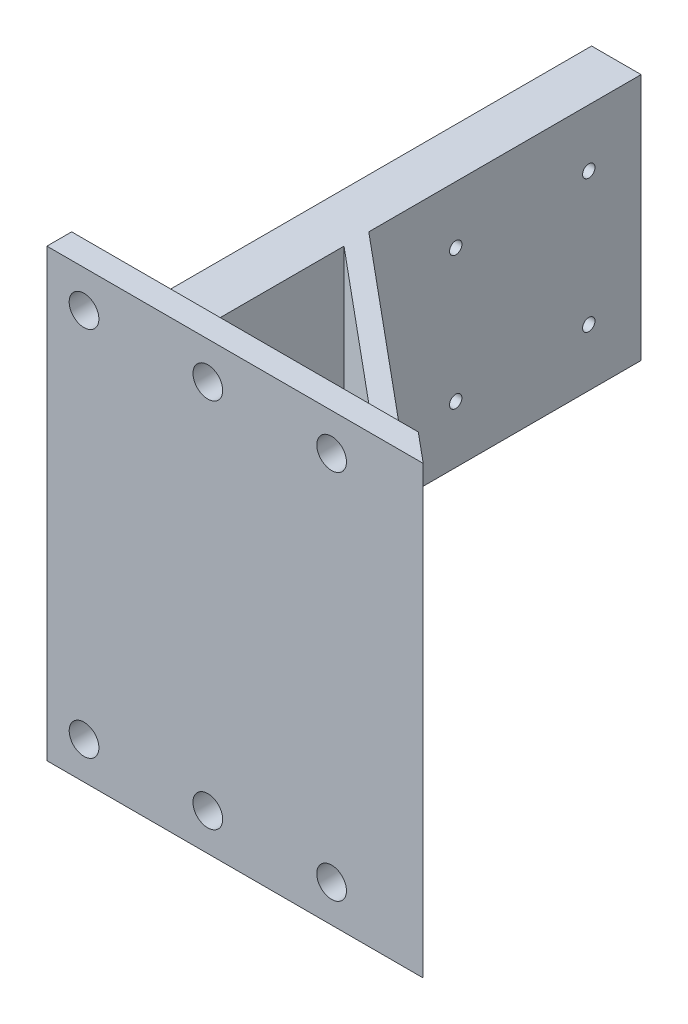
ISO-10303-21;
HEADER;
FILE_DESCRIPTION(('STEP AP214'),'2;1');
FILE_NAME('part.step','',(''),(''),'','','');
FILE_SCHEMA(('AUTOMOTIVE_DESIGN { 1 0 10303 214 1 1 1 1 }'));
ENDSEC;
DATA;
#1=APPLICATION_CONTEXT('core data for automotive mechanical design processes');
#2=APPLICATION_PROTOCOL_DEFINITION('international standard','automotive_design',2000,#1);
#3=PRODUCT_CONTEXT('',#1,'mechanical');
#4=PRODUCT('Part','Part','',(#3));
#5=PRODUCT_RELATED_PRODUCT_CATEGORY('part','',(#4));
#6=PRODUCT_DEFINITION_FORMATION('','',#4);
#7=PRODUCT_DEFINITION_CONTEXT('part definition',#1,'design');
#8=PRODUCT_DEFINITION('design','',#6,#7);
#9=PRODUCT_DEFINITION_SHAPE('','',#8);
#10=(LENGTH_UNIT() NAMED_UNIT(*) SI_UNIT(.MILLI.,.METRE.));
#11=(NAMED_UNIT(*) PLANE_ANGLE_UNIT() SI_UNIT($,.RADIAN.));
#12=(NAMED_UNIT(*) SI_UNIT($,.STERADIAN.) SOLID_ANGLE_UNIT());
#13=UNCERTAINTY_MEASURE_WITH_UNIT(LENGTH_MEASURE(1.E-05),#10,'distance_accuracy_value','');
#14=(GEOMETRIC_REPRESENTATION_CONTEXT(3) GLOBAL_UNCERTAINTY_ASSIGNED_CONTEXT((#13)) GLOBAL_UNIT_ASSIGNED_CONTEXT((#10,
#11,#12)) REPRESENTATION_CONTEXT('',''));
#15=CARTESIAN_POINT('',(0.,0.,0.));
#16=DIRECTION('',(0.,0.,1.));
#17=DIRECTION('',(1.,0.,0.));
#18=AXIS2_PLACEMENT_3D('',#15,#16,#17);
#19=CARTESIAN_POINT('',(10.,50.,-5.));
#20=DIRECTION('',(0.,0.,-1.));
#21=DIRECTION('',(-1.,0.,0.));
#22=AXIS2_PLACEMENT_3D('',#19,#20,#21);
#23=PLANE('',#22);
#24=CARTESIAN_POINT('',(57.5,-12.4999999999997,-5.));
#25=DIRECTION('',(0.,0.,1.));
#26=DIRECTION('',(-1.,0.,0.));
#27=AXIS2_PLACEMENT_3D('',#24,#25,#26);
#28=CIRCLE('',#27,3.00000000000001);
#29=CARTESIAN_POINT('',(54.5,-12.4999999999997,-5.));
#30=VERTEX_POINT('',#29);
#31=EDGE_CURVE('E325',#30,#30,#28,.T.);
#32=ORIENTED_EDGE('',*,*,#31,.T.);
#33=EDGE_LOOP('',(#32));
#34=FACE_BOUND('',#33,.T.);
#35=CARTESIAN_POINT('',(7.5,-12.5,-5.));
#36=DIRECTION('',(0.,0.,1.));
#37=DIRECTION('',(-1.,0.,0.));
#38=AXIS2_PLACEMENT_3D('',#35,#36,#37);
#39=CIRCLE('',#38,3.);
#40=CARTESIAN_POINT('',(4.5,-12.5,-5.));
#41=VERTEX_POINT('',#40);
#42=EDGE_CURVE('E319',#41,#41,#39,.T.);
#43=ORIENTED_EDGE('',*,*,#42,.T.);
#44=EDGE_LOOP('',(#43));
#45=FACE_BOUND('',#44,.T.);
#46=CARTESIAN_POINT('',(32.5,-12.4999999999998,-5.));
#47=DIRECTION('',(0.,0.,1.));
#48=DIRECTION('',(-1.,0.,0.));
#49=AXIS2_PLACEMENT_3D('',#46,#47,#48);
#50=CIRCLE('',#49,3.);
#51=CARTESIAN_POINT('',(29.5,-12.4999999999998,-5.));
#52=VERTEX_POINT('',#51);
#53=EDGE_CURVE('E322',#52,#52,#50,.T.);
#54=ORIENTED_EDGE('',*,*,#53,.T.);
#55=EDGE_LOOP('',(#54));
#56=FACE_BOUND('',#55,.T.);
#57=CARTESIAN_POINT('',(57.5,62.4999999999997,-5.));
#58=DIRECTION('',(0.,0.,-1.));
#59=DIRECTION('',(-1.,0.,0.));
#60=AXIS2_PLACEMENT_3D('',#57,#58,#59);
#61=CIRCLE('',#60,3.00000000000001);
#62=CARTESIAN_POINT('',(54.5,62.4999999999997,-5.));
#63=VERTEX_POINT('',#62);
#64=EDGE_CURVE('E342',#63,#63,#61,.T.);
#65=ORIENTED_EDGE('',*,*,#64,.F.);
#66=EDGE_LOOP('',(#65));
#67=FACE_BOUND('',#66,.T.);
#68=CARTESIAN_POINT('',(7.5,62.5,-5.));
#69=DIRECTION('',(0.,0.,-1.));
#70=DIRECTION('',(-1.,0.,0.));
#71=AXIS2_PLACEMENT_3D('',#68,#69,#70);
#72=CIRCLE('',#71,3.);
#73=CARTESIAN_POINT('',(4.5,62.5,-5.));
#74=VERTEX_POINT('',#73);
#75=EDGE_CURVE('E335',#74,#74,#72,.T.);
#76=ORIENTED_EDGE('',*,*,#75,.F.);
#77=EDGE_LOOP('',(#76));
#78=FACE_BOUND('',#77,.T.);
#79=CARTESIAN_POINT('',(32.5,62.4999999999998,-5.));
#80=DIRECTION('',(0.,0.,-1.));
#81=DIRECTION('',(-1.,0.,0.));
#82=AXIS2_PLACEMENT_3D('',#79,#80,#81);
#83=CIRCLE('',#82,3.);
#84=CARTESIAN_POINT('',(29.5,62.4999999999998,-5.));
#85=VERTEX_POINT('',#84);
#86=EDGE_CURVE('E338',#85,#85,#83,.T.);
#87=ORIENTED_EDGE('',*,*,#86,.F.);
#88=EDGE_LOOP('',(#87));
#89=FACE_BOUND('',#88,.T.);
#90=DIRECTION('',(1.,0.,0.));
#91=VECTOR('',#90,1.);
#92=CARTESIAN_POINT('',(76.,0.,-5.));
#93=LINE('',#92,#91);
#94=CARTESIAN_POINT('',(64.,0.,-5.));
#95=VERTEX_POINT('',#94);
#96=CARTESIAN_POINT('',(70.,0.,-5.));
#97=VERTEX_POINT('',#96);
#98=EDGE_CURVE('E42',#95,#97,#93,.T.);
#99=ORIENTED_EDGE('',*,*,#98,.T.);
#100=DIRECTION('',(0.,1.,0.));
#101=VECTOR('',#100,1.);
#102=CARTESIAN_POINT('',(70.,-44.,-5.));
#103=LINE('',#102,#101);
#104=CARTESIAN_POINT('',(70.,-20.,-5.));
#105=VERTEX_POINT('',#104);
#106=EDGE_CURVE('E123',#105,#97,#103,.T.);
#107=ORIENTED_EDGE('',*,*,#106,.F.);
#108=DIRECTION('',(-1.,0.,0.));
#109=VECTOR('',#108,1.);
#110=CARTESIAN_POINT('',(0.,-20.,-5.));
#111=LINE('',#110,#109);
#112=CARTESIAN_POINT('',(0.,-20.,-5.));
#113=VERTEX_POINT('',#112);
#114=EDGE_CURVE('E157',#105,#113,#111,.T.);
#115=ORIENTED_EDGE('',*,*,#114,.T.);
#116=DIRECTION('',(0.,1.,0.));
#117=VECTOR('',#116,1.);
#118=CARTESIAN_POINT('',(0.,0.,-5.));
#119=LINE('',#118,#117);
#120=CARTESIAN_POINT('',(0.,0.,-5.));
#121=VERTEX_POINT('',#120);
#122=EDGE_CURVE('E154',#113,#121,#119,.T.);
#123=ORIENTED_EDGE('',*,*,#122,.T.);
#124=CARTESIAN_POINT('',(10.,0.,-5.));
#125=VERTEX_POINT('',#124);
#126=EDGE_CURVE('E49',#121,#125,#93,.T.);
#127=ORIENTED_EDGE('',*,*,#126,.T.);
#128=DIRECTION('',(0.,-1.,0.));
#129=VECTOR('',#128,1.);
#130=CARTESIAN_POINT('',(10.,50.,-5.));
#131=LINE('',#130,#129);
#132=CARTESIAN_POINT('',(9.99999999999999,50.,-5.));
#133=VERTEX_POINT('',#132);
#134=EDGE_CURVE('E142',#133,#125,#131,.T.);
#135=ORIENTED_EDGE('',*,*,#134,.F.);
#136=DIRECTION('',(1.,0.,0.));
#137=VECTOR('',#136,1.);
#138=CARTESIAN_POINT('',(76.,50.,-5.));
#139=LINE('',#138,#137);
#140=CARTESIAN_POINT('',(0.,50.,-5.));
#141=VERTEX_POINT('',#140);
#142=EDGE_CURVE('E152',#141,#133,#139,.T.);
#143=ORIENTED_EDGE('',*,*,#142,.F.);
#144=DIRECTION('',(0.,-1.,0.));
#145=VECTOR('',#144,1.);
#146=CARTESIAN_POINT('',(0.,50.,-5.));
#147=LINE('',#146,#145);
#148=CARTESIAN_POINT('',(0.,70.,-5.));
#149=VERTEX_POINT('',#148);
#150=EDGE_CURVE('E176',#149,#141,#147,.T.);
#151=ORIENTED_EDGE('',*,*,#150,.F.);
#152=DIRECTION('',(-1.,0.,0.));
#153=VECTOR('',#152,1.);
#154=CARTESIAN_POINT('',(0.,70.,-5.));
#155=LINE('',#154,#153);
#156=CARTESIAN_POINT('',(70.,70.,-5.));
#157=VERTEX_POINT('',#156);
#158=EDGE_CURVE('E174',#157,#149,#155,.T.);
#159=ORIENTED_EDGE('',*,*,#158,.F.);
#160=DIRECTION('',(0.,-1.,0.));
#161=VECTOR('',#160,1.);
#162=CARTESIAN_POINT('',(70.,94.,-5.));
#163=LINE('',#162,#161);
#164=CARTESIAN_POINT('',(70.,50.,-5.));
#165=VERTEX_POINT('',#164);
#166=EDGE_CURVE('E168',#157,#165,#163,.T.);
#167=ORIENTED_EDGE('',*,*,#166,.T.);
#168=CARTESIAN_POINT('',(64.,50.,-5.));
#169=VERTEX_POINT('',#168);
#170=EDGE_CURVE('E147',#169,#165,#139,.T.);
#171=ORIENTED_EDGE('',*,*,#170,.F.);
#172=DIRECTION('',(0.,-1.,0.));
#173=VECTOR('',#172,1.);
#174=CARTESIAN_POINT('',(64.,50.,-5.));
#175=LINE('',#174,#173);
#176=EDGE_CURVE('E145',#169,#95,#175,.T.);
#177=ORIENTED_EDGE('',*,*,#176,.T.);
#178=EDGE_LOOP('',(#99,#107,#115,#123,#127,#135,#143,#151,#159,#167,#171,#177));
#179=FACE_BOUND('',#178,.T.);
#180=ADVANCED_FACE('F34',(#34,#45,#56,#67,#78,#89,#179),#23,.T.);
#181=CARTESIAN_POINT('',(0.,-20.,-5.));
#182=DIRECTION('',(0.,1.,0.));
#183=DIRECTION('',(0.,0.,1.));
#184=AXIS2_PLACEMENT_3D('',#181,#182,#183);
#185=PLANE('',#184);
#186=DIRECTION('',(-0.768221279597376,0.,-0.64018439966448));
#187=VECTOR('',#186,1.);
#188=CARTESIAN_POINT('',(28.6885245901639,-20.,-39.4262295081967));
#189=LINE('',#188,#187);
#190=CARTESIAN_POINT('',(76.,-20.,0.));
#191=VERTEX_POINT('',#190);
#192=EDGE_CURVE('E11',#191,#105,#189,.T.);
#193=ORIENTED_EDGE('',*,*,#192,.F.);
#194=DIRECTION('',(-1.,0.,0.));
#195=VECTOR('',#194,1.);
#196=CARTESIAN_POINT('',(0.,-20.,0.));
#197=LINE('',#196,#195);
#198=CARTESIAN_POINT('',(0.,-20.,0.));
#199=VERTEX_POINT('',#198);
#200=EDGE_CURVE('E133',#191,#199,#197,.T.);
#201=ORIENTED_EDGE('',*,*,#200,.T.);
#202=DIRECTION('',(0.,0.,1.));
#203=VECTOR('',#202,1.);
#204=CARTESIAN_POINT('',(0.,-20.,-5.));
#205=LINE('',#204,#203);
#206=EDGE_CURVE('E166',#113,#199,#205,.T.);
#207=ORIENTED_EDGE('',*,*,#206,.F.);
#208=ORIENTED_EDGE('',*,*,#114,.F.);
#209=EDGE_LOOP('',(#193,#201,#207,#208));
#210=FACE_BOUND('',#209,.T.);
#211=ADVANCED_FACE('F222',(#210),#185,.F.);
#212=CARTESIAN_POINT('',(0.,50.,0.));
#213=DIRECTION('',(0.,-1.,0.));
#214=DIRECTION('',(0.,0.,-1.));
#215=AXIS2_PLACEMENT_3D('',#212,#213,#214);
#216=PLANE('',#215);
#217=DIRECTION('',(0.,0.,1.));
#218=VECTOR('',#217,1.);
#219=CARTESIAN_POINT('',(0.,50.,0.));
#220=LINE('',#219,#218);
#221=CARTESIAN_POINT('',(0.,50.,-110.));
#222=VERTEX_POINT('',#221);
#223=EDGE_CURVE('E203',#222,#141,#220,.T.);
#224=ORIENTED_EDGE('',*,*,#223,.T.);
#225=ORIENTED_EDGE('',*,*,#142,.T.);
#226=DIRECTION('',(0.,0.,1.));
#227=VECTOR('',#226,1.);
#228=CARTESIAN_POINT('',(10.,50.,-50.));
#229=LINE('',#228,#227);
#230=CARTESIAN_POINT('',(10.,50.,-50.));
#231=VERTEX_POINT('',#230);
#232=EDGE_CURVE('E184',#231,#133,#229,.T.);
#233=ORIENTED_EDGE('',*,*,#232,.F.);
#234=DIRECTION('',(-0.768221279597376,0.,-0.64018439966448));
#235=VECTOR('',#234,1.);
#236=CARTESIAN_POINT('',(64.,50.,-5.));
#237=LINE('',#236,#235);
#238=EDGE_CURVE('E187',#169,#231,#237,.T.);
#239=ORIENTED_EDGE('',*,*,#238,.F.);
#240=ORIENTED_EDGE('',*,*,#170,.T.);
#241=DIRECTION('',(-0.768221279597376,0.,-0.64018439966448));
#242=VECTOR('',#241,1.);
#243=CARTESIAN_POINT('',(10.,50.,-55.));
#244=LINE('',#243,#242);
#245=CARTESIAN_POINT('',(10.,50.,-55.));
#246=VERTEX_POINT('',#245);
#247=EDGE_CURVE('E196',#165,#246,#244,.T.);
#248=ORIENTED_EDGE('',*,*,#247,.T.);
#249=DIRECTION('',(0.,0.,-1.));
#250=VECTOR('',#249,1.);
#251=CARTESIAN_POINT('',(9.99999999999998,50.,-110.));
#252=LINE('',#251,#250);
#253=CARTESIAN_POINT('',(9.99999999999998,50.,-110.));
#254=VERTEX_POINT('',#253);
#255=EDGE_CURVE('E198',#246,#254,#252,.T.);
#256=ORIENTED_EDGE('',*,*,#255,.T.);
#257=DIRECTION('',(-1.,0.,0.));
#258=VECTOR('',#257,1.);
#259=CARTESIAN_POINT('',(0.,50.,-110.));
#260=LINE('',#259,#258);
#261=EDGE_CURVE('E201',#254,#222,#260,.T.);
#262=ORIENTED_EDGE('',*,*,#261,.T.);
#263=EDGE_LOOP('',(#224,#225,#233,#239,#240,#248,#256,#262));
#264=FACE_BOUND('',#263,.T.);
#265=ADVANCED_FACE('F233',(#264),#216,.F.);
#266=CARTESIAN_POINT('',(0.,0.,0.));
#267=DIRECTION('',(0.,-1.,0.));
#268=DIRECTION('',(0.,0.,-1.));
#269=AXIS2_PLACEMENT_3D('',#266,#267,#268);
#270=PLANE('',#269);
#271=ORIENTED_EDGE('',*,*,#126,.F.);
#272=DIRECTION('',(0.,0.,1.));
#273=VECTOR('',#272,1.);
#274=CARTESIAN_POINT('',(0.,0.,0.));
#275=LINE('',#274,#273);
#276=CARTESIAN_POINT('',(0.,0.,-110.));
#277=VERTEX_POINT('',#276);
#278=EDGE_CURVE('E199',#277,#121,#275,.T.);
#279=ORIENTED_EDGE('',*,*,#278,.F.);
#280=DIRECTION('',(-1.,0.,0.));
#281=VECTOR('',#280,1.);
#282=CARTESIAN_POINT('',(0.,0.,-110.));
#283=LINE('',#282,#281);
#284=CARTESIAN_POINT('',(9.99999999999998,0.,-110.));
#285=VERTEX_POINT('',#284);
#286=EDGE_CURVE('E208',#285,#277,#283,.T.);
#287=ORIENTED_EDGE('',*,*,#286,.F.);
#288=DIRECTION('',(0.,0.,-1.));
#289=VECTOR('',#288,1.);
#290=CARTESIAN_POINT('',(9.99999999999998,0.,-110.));
#291=LINE('',#290,#289);
#292=CARTESIAN_POINT('',(10.,0.,-55.));
#293=VERTEX_POINT('',#292);
#294=EDGE_CURVE('E141',#293,#285,#291,.T.);
#295=ORIENTED_EDGE('',*,*,#294,.F.);
#296=DIRECTION('',(-0.768221279597376,0.,-0.64018439966448));
#297=VECTOR('',#296,1.);
#298=CARTESIAN_POINT('',(10.,0.,-55.));
#299=LINE('',#298,#297);
#300=EDGE_CURVE('E127',#97,#293,#299,.T.);
#301=ORIENTED_EDGE('',*,*,#300,.F.);
#302=ORIENTED_EDGE('',*,*,#98,.F.);
#303=DIRECTION('',(-0.768221279597376,0.,-0.64018439966448));
#304=VECTOR('',#303,1.);
#305=CARTESIAN_POINT('',(64.,0.,-5.));
#306=LINE('',#305,#304);
#307=CARTESIAN_POINT('',(10.,0.,-50.));
#308=VERTEX_POINT('',#307);
#309=EDGE_CURVE('E188',#95,#308,#306,.T.);
#310=ORIENTED_EDGE('',*,*,#309,.T.);
#311=DIRECTION('',(0.,0.,1.));
#312=VECTOR('',#311,1.);
#313=CARTESIAN_POINT('',(10.,0.,-50.));
#314=LINE('',#313,#312);
#315=EDGE_CURVE('E56',#308,#125,#314,.T.);
#316=ORIENTED_EDGE('',*,*,#315,.T.);
#317=EDGE_LOOP('',(#271,#279,#287,#295,#301,#302,#310,#316));
#318=FACE_BOUND('',#317,.T.);
#319=ADVANCED_FACE('F137',(#318),#270,.T.);
#320=CARTESIAN_POINT('',(76.,50.,0.));
#321=DIRECTION('',(0.,0.,-1.));
#322=DIRECTION('',(-1.,0.,0.));
#323=AXIS2_PLACEMENT_3D('',#320,#321,#322);
#324=PLANE('',#323);
#325=CARTESIAN_POINT('',(57.5,-12.4999999999997,0.));
#326=DIRECTION('',(0.,0.,1.));
#327=DIRECTION('',(-1.,0.,0.));
#328=AXIS2_PLACEMENT_3D('',#325,#326,#327);
#329=CIRCLE('',#328,3.00000000000001);
#330=CARTESIAN_POINT('',(54.5,-12.4999999999997,0.));
#331=VERTEX_POINT('',#330);
#332=EDGE_CURVE('E320',#331,#331,#329,.T.);
#333=ORIENTED_EDGE('',*,*,#332,.F.);
#334=EDGE_LOOP('',(#333));
#335=FACE_BOUND('',#334,.T.);
#336=CARTESIAN_POINT('',(7.5,-12.5,0.));
#337=DIRECTION('',(0.,0.,1.));
#338=DIRECTION('',(-1.,0.,0.));
#339=AXIS2_PLACEMENT_3D('',#336,#337,#338);
#340=CIRCLE('',#339,3.);
#341=CARTESIAN_POINT('',(4.5,-12.5,0.));
#342=VERTEX_POINT('',#341);
#343=EDGE_CURVE('E316',#342,#342,#340,.T.);
#344=ORIENTED_EDGE('',*,*,#343,.F.);
#345=EDGE_LOOP('',(#344));
#346=FACE_BOUND('',#345,.T.);
#347=CARTESIAN_POINT('',(32.5,-12.4999999999998,0.));
#348=DIRECTION('',(0.,0.,1.));
#349=DIRECTION('',(-1.,0.,0.));
#350=AXIS2_PLACEMENT_3D('',#347,#348,#349);
#351=CIRCLE('',#350,3.);
#352=CARTESIAN_POINT('',(29.5,-12.4999999999998,0.));
#353=VERTEX_POINT('',#352);
#354=EDGE_CURVE('E329',#353,#353,#351,.T.);
#355=ORIENTED_EDGE('',*,*,#354,.F.);
#356=EDGE_LOOP('',(#355));
#357=FACE_BOUND('',#356,.T.);
#358=CARTESIAN_POINT('',(57.5,62.4999999999997,0.));
#359=DIRECTION('',(0.,0.,-1.));
#360=DIRECTION('',(-1.,0.,0.));
#361=AXIS2_PLACEMENT_3D('',#358,#359,#360);
#362=CIRCLE('',#361,3.00000000000001);
#363=CARTESIAN_POINT('',(54.5,62.4999999999997,0.));
#364=VERTEX_POINT('',#363);
#365=EDGE_CURVE('E332',#364,#364,#362,.T.);
#366=ORIENTED_EDGE('',*,*,#365,.T.);
#367=EDGE_LOOP('',(#366));
#368=FACE_BOUND('',#367,.T.);
#369=CARTESIAN_POINT('',(7.5,62.5,0.));
#370=DIRECTION('',(0.,0.,-1.));
#371=DIRECTION('',(-1.,0.,0.));
#372=AXIS2_PLACEMENT_3D('',#369,#370,#371);
#373=CIRCLE('',#372,3.);
#374=CARTESIAN_POINT('',(4.5,62.5,0.));
#375=VERTEX_POINT('',#374);
#376=EDGE_CURVE('E339',#375,#375,#373,.T.);
#377=ORIENTED_EDGE('',*,*,#376,.T.);
#378=EDGE_LOOP('',(#377));
#379=FACE_BOUND('',#378,.T.);
#380=CARTESIAN_POINT('',(32.5,62.4999999999998,0.));
#381=DIRECTION('',(0.,0.,-1.));
#382=DIRECTION('',(-1.,0.,0.));
#383=AXIS2_PLACEMENT_3D('',#380,#381,#382);
#384=CIRCLE('',#383,3.);
#385=CARTESIAN_POINT('',(29.5,62.4999999999998,0.));
#386=VERTEX_POINT('',#385);
#387=EDGE_CURVE('E347',#386,#386,#384,.T.);
#388=ORIENTED_EDGE('',*,*,#387,.T.);
#389=EDGE_LOOP('',(#388));
#390=FACE_BOUND('',#389,.T.);
#391=DIRECTION('',(0.,-1.,0.));
#392=VECTOR('',#391,1.);
#393=CARTESIAN_POINT('',(0.,50.,0.));
#394=LINE('',#393,#392);
#395=CARTESIAN_POINT('',(0.,70.,0.));
#396=VERTEX_POINT('',#395);
#397=EDGE_CURVE('E205',#396,#199,#394,.T.);
#398=ORIENTED_EDGE('',*,*,#397,.T.);
#399=ORIENTED_EDGE('',*,*,#200,.F.);
#400=DIRECTION('',(0.,-1.,0.));
#401=VECTOR('',#400,1.);
#402=CARTESIAN_POINT('',(76.,50.,0.));
#403=LINE('',#402,#401);
#404=CARTESIAN_POINT('',(76.,70.,0.));
#405=VERTEX_POINT('',#404);
#406=EDGE_CURVE('E150',#405,#191,#403,.T.);
#407=ORIENTED_EDGE('',*,*,#406,.F.);
#408=DIRECTION('',(-1.,0.,0.));
#409=VECTOR('',#408,1.);
#410=CARTESIAN_POINT('',(0.,70.,0.));
#411=LINE('',#410,#409);
#412=EDGE_CURVE('E172',#405,#396,#411,.T.);
#413=ORIENTED_EDGE('',*,*,#412,.T.);
#414=EDGE_LOOP('',(#398,#399,#407,#413));
#415=FACE_BOUND('',#414,.T.);
#416=ADVANCED_FACE('F36',(#335,#346,#357,#368,#379,#390,#415),#324,.F.);
#417=CARTESIAN_POINT('',(10.,50.,-55.));
#418=DIRECTION('',(-0.64018439966448,0.,0.768221279597376));
#419=DIRECTION('',(0.768221279597376,0.,0.64018439966448));
#420=AXIS2_PLACEMENT_3D('',#417,#418,#419);
#421=PLANE('',#420);
#422=ORIENTED_EDGE('',*,*,#406,.T.);
#423=ORIENTED_EDGE('',*,*,#192,.T.);
#424=ORIENTED_EDGE('',*,*,#106,.T.);
#425=ORIENTED_EDGE('',*,*,#300,.T.);
#426=DIRECTION('',(0.,-1.,0.));
#427=VECTOR('',#426,1.);
#428=CARTESIAN_POINT('',(10.,50.,-55.));
#429=LINE('',#428,#427);
#430=EDGE_CURVE('E218',#246,#293,#429,.T.);
#431=ORIENTED_EDGE('',*,*,#430,.F.);
#432=ORIENTED_EDGE('',*,*,#247,.F.);
#433=ORIENTED_EDGE('',*,*,#166,.F.);
#434=DIRECTION('',(0.768221279597376,0.,0.64018439966448));
#435=VECTOR('',#434,1.);
#436=CARTESIAN_POINT('',(28.6885245901639,70.,-39.4262295081967));
#437=LINE('',#436,#435);
#438=EDGE_CURVE('E170',#157,#405,#437,.T.);
#439=ORIENTED_EDGE('',*,*,#438,.T.);
#440=EDGE_LOOP('',(#422,#423,#424,#425,#431,#432,#433,#439));
#441=FACE_BOUND('',#440,.T.);
#442=ADVANCED_FACE('F125',(#441),#421,.F.);
#443=CARTESIAN_POINT('',(9.99999999999998,50.,-110.));
#444=DIRECTION('',(-1.,0.,0.));
#445=DIRECTION('',(0.,0.,1.));
#446=AXIS2_PLACEMENT_3D('',#443,#444,#445);
#447=PLANE('',#446);
#448=CARTESIAN_POINT('',(9.99999999999999,38.4350288425444,-72.5649711574556));
#449=DIRECTION('',(-1.,0.,0.));
#450=DIRECTION('',(0.,0.,1.));
#451=AXIS2_PLACEMENT_3D('',#448,#449,#450);
#452=CIRCLE('',#451,1.25);
#453=CARTESIAN_POINT('',(9.99999999999999,38.4350288425444,-71.3149711574556));
#454=VERTEX_POINT('',#453);
#455=EDGE_CURVE('E134',#454,#454,#452,.T.);
#456=ORIENTED_EDGE('',*,*,#455,.T.);
#457=EDGE_LOOP('',(#456));
#458=FACE_BOUND('',#457,.T.);
#459=CARTESIAN_POINT('',(9.99999999999998,11.5649711574553,-99.4350288425441));
#460=DIRECTION('',(-1.,0.,0.));
#461=DIRECTION('',(0.,0.,1.));
#462=AXIS2_PLACEMENT_3D('',#459,#460,#461);
#463=CIRCLE('',#462,1.25000000000001);
#464=CARTESIAN_POINT('',(9.99999999999998,11.5649711574553,-98.1850288425441));
#465=VERTEX_POINT('',#464);
#466=EDGE_CURVE('E370',#465,#465,#463,.T.);
#467=ORIENTED_EDGE('',*,*,#466,.T.);
#468=EDGE_LOOP('',(#467));
#469=FACE_BOUND('',#468,.T.);
#470=CARTESIAN_POINT('',(9.99999999999999,11.5649711574556,-72.5649711574552));
#471=DIRECTION('',(-1.,0.,0.));
#472=DIRECTION('',(0.,0.,1.));
#473=AXIS2_PLACEMENT_3D('',#470,#471,#472);
#474=CIRCLE('',#473,1.25);
#475=CARTESIAN_POINT('',(9.99999999999999,11.5649711574556,-71.3149711574552));
#476=VERTEX_POINT('',#475);
#477=EDGE_CURVE('E367',#476,#476,#474,.T.);
#478=ORIENTED_EDGE('',*,*,#477,.T.);
#479=EDGE_LOOP('',(#478));
#480=FACE_BOUND('',#479,.T.);
#481=CARTESIAN_POINT('',(9.99999999999998,38.4350288425441,-99.4350288425443));
#482=DIRECTION('',(-1.,0.,0.));
#483=DIRECTION('',(0.,0.,1.));
#484=AXIS2_PLACEMENT_3D('',#481,#482,#483);
#485=CIRCLE('',#484,1.24999999999999);
#486=CARTESIAN_POINT('',(9.99999999999998,38.4350288425441,-98.1850288425443));
#487=VERTEX_POINT('',#486);
#488=EDGE_CURVE('E364',#487,#487,#485,.T.);
#489=ORIENTED_EDGE('',*,*,#488,.T.);
#490=EDGE_LOOP('',(#489));
#491=FACE_BOUND('',#490,.T.);
#492=ORIENTED_EDGE('',*,*,#294,.T.);
#493=DIRECTION('',(0.,-1.,0.));
#494=VECTOR('',#493,1.);
#495=CARTESIAN_POINT('',(9.99999999999998,50.,-110.));
#496=LINE('',#495,#494);
#497=EDGE_CURVE('E215',#254,#285,#496,.T.);
#498=ORIENTED_EDGE('',*,*,#497,.F.);
#499=ORIENTED_EDGE('',*,*,#255,.F.);
#500=ORIENTED_EDGE('',*,*,#430,.T.);
#501=EDGE_LOOP('',(#492,#498,#499,#500));
#502=FACE_BOUND('',#501,.T.);
#503=ADVANCED_FACE('F242',(#458,#469,#480,#491,#502),#447,.F.);
#504=CARTESIAN_POINT('',(0.,50.,-110.));
#505=DIRECTION('',(0.,0.,1.));
#506=DIRECTION('',(1.,0.,0.));
#507=AXIS2_PLACEMENT_3D('',#504,#505,#506);
#508=PLANE('',#507);
#509=ORIENTED_EDGE('',*,*,#286,.T.);
#510=DIRECTION('',(0.,-1.,0.));
#511=VECTOR('',#510,1.);
#512=CARTESIAN_POINT('',(0.,50.,-110.));
#513=LINE('',#512,#511);
#514=EDGE_CURVE('E212',#222,#277,#513,.T.);
#515=ORIENTED_EDGE('',*,*,#514,.F.);
#516=ORIENTED_EDGE('',*,*,#261,.F.);
#517=ORIENTED_EDGE('',*,*,#497,.T.);
#518=EDGE_LOOP('',(#509,#515,#516,#517));
#519=FACE_BOUND('',#518,.T.);
#520=ADVANCED_FACE('F240',(#519),#508,.F.);
#521=CARTESIAN_POINT('',(0.,50.,0.));
#522=DIRECTION('',(1.,0.,0.));
#523=DIRECTION('',(0.,0.,-1.));
#524=AXIS2_PLACEMENT_3D('',#521,#522,#523);
#525=PLANE('',#524);
#526=CARTESIAN_POINT('',(0.,38.4350288425444,-72.5649711574556));
#527=DIRECTION('',(-1.,0.,0.));
#528=DIRECTION('',(0.,0.,1.));
#529=AXIS2_PLACEMENT_3D('',#526,#527,#528);
#530=CIRCLE('',#529,1.25);
#531=CARTESIAN_POINT('',(0.,38.4350288425444,-71.3149711574556));
#532=VERTEX_POINT('',#531);
#533=EDGE_CURVE('E356',#532,#532,#530,.T.);
#534=ORIENTED_EDGE('',*,*,#533,.F.);
#535=EDGE_LOOP('',(#534));
#536=FACE_BOUND('',#535,.T.);
#537=CARTESIAN_POINT('',(0.,11.5649711574553,-99.4350288425441));
#538=DIRECTION('',(-1.,0.,0.));
#539=DIRECTION('',(0.,0.,1.));
#540=AXIS2_PLACEMENT_3D('',#537,#538,#539);
#541=CIRCLE('',#540,1.25000000000001);
#542=CARTESIAN_POINT('',(0.,11.5649711574553,-98.1850288425441));
#543=VERTEX_POINT('',#542);
#544=EDGE_CURVE('E355',#543,#543,#541,.T.);
#545=ORIENTED_EDGE('',*,*,#544,.F.);
#546=EDGE_LOOP('',(#545));
#547=FACE_BOUND('',#546,.T.);
#548=CARTESIAN_POINT('',(0.,11.5649711574556,-72.5649711574552));
#549=DIRECTION('',(-1.,0.,0.));
#550=DIRECTION('',(0.,0.,1.));
#551=AXIS2_PLACEMENT_3D('',#548,#549,#550);
#552=CIRCLE('',#551,1.25);
#553=CARTESIAN_POINT('',(0.,11.5649711574556,-71.3149711574552));
#554=VERTEX_POINT('',#553);
#555=EDGE_CURVE('E350',#554,#554,#552,.T.);
#556=ORIENTED_EDGE('',*,*,#555,.F.);
#557=EDGE_LOOP('',(#556));
#558=FACE_BOUND('',#557,.T.);
#559=CARTESIAN_POINT('',(0.,38.4350288425441,-99.4350288425443));
#560=DIRECTION('',(-1.,0.,0.));
#561=DIRECTION('',(0.,0.,1.));
#562=AXIS2_PLACEMENT_3D('',#559,#560,#561);
#563=CIRCLE('',#562,1.24999999999999);
#564=CARTESIAN_POINT('',(0.,38.4350288425441,-98.1850288425443));
#565=VERTEX_POINT('',#564);
#566=EDGE_CURVE('E359',#565,#565,#563,.T.);
#567=ORIENTED_EDGE('',*,*,#566,.F.);
#568=EDGE_LOOP('',(#567));
#569=FACE_BOUND('',#568,.T.);
#570=ORIENTED_EDGE('',*,*,#278,.T.);
#571=ORIENTED_EDGE('',*,*,#122,.F.);
#572=ORIENTED_EDGE('',*,*,#206,.T.);
#573=ORIENTED_EDGE('',*,*,#397,.F.);
#574=DIRECTION('',(0.,0.,1.));
#575=VECTOR('',#574,1.);
#576=CARTESIAN_POINT('',(0.,70.,-5.));
#577=LINE('',#576,#575);
#578=EDGE_CURVE('E179',#149,#396,#577,.T.);
#579=ORIENTED_EDGE('',*,*,#578,.F.);
#580=ORIENTED_EDGE('',*,*,#150,.T.);
#581=ORIENTED_EDGE('',*,*,#223,.F.);
#582=ORIENTED_EDGE('',*,*,#514,.T.);
#583=EDGE_LOOP('',(#570,#571,#572,#573,#579,#580,#581,#582));
#584=FACE_BOUND('',#583,.T.);
#585=ADVANCED_FACE('F225',(#536,#547,#558,#569,#584),#525,.F.);
#586=CARTESIAN_POINT('',(10.,50.,-50.));
#587=DIRECTION('',(1.,0.,0.));
#588=DIRECTION('',(0.,0.,-1.));
#589=AXIS2_PLACEMENT_3D('',#586,#587,#588);
#590=PLANE('',#589);
#591=ORIENTED_EDGE('',*,*,#315,.F.);
#592=DIRECTION('',(0.,-1.,0.));
#593=VECTOR('',#592,1.);
#594=CARTESIAN_POINT('',(10.,50.,-50.));
#595=LINE('',#594,#593);
#596=EDGE_CURVE('E190',#231,#308,#595,.T.);
#597=ORIENTED_EDGE('',*,*,#596,.F.);
#598=ORIENTED_EDGE('',*,*,#232,.T.);
#599=ORIENTED_EDGE('',*,*,#134,.T.);
#600=EDGE_LOOP('',(#591,#597,#598,#599));
#601=FACE_BOUND('',#600,.T.);
#602=ADVANCED_FACE('F247',(#601),#590,.T.);
#603=CARTESIAN_POINT('',(64.,50.,-5.));
#604=DIRECTION('',(-0.64018439966448,0.,0.768221279597376));
#605=DIRECTION('',(0.768221279597376,0.,0.64018439966448));
#606=AXIS2_PLACEMENT_3D('',#603,#604,#605);
#607=PLANE('',#606);
#608=ORIENTED_EDGE('',*,*,#309,.F.);
#609=ORIENTED_EDGE('',*,*,#176,.F.);
#610=ORIENTED_EDGE('',*,*,#238,.T.);
#611=ORIENTED_EDGE('',*,*,#596,.T.);
#612=EDGE_LOOP('',(#608,#609,#610,#611));
#613=FACE_BOUND('',#612,.T.);
#614=ADVANCED_FACE('F246',(#613),#607,.T.);
#615=CARTESIAN_POINT('',(0.,70.,-5.));
#616=DIRECTION('',(0.,1.,0.));
#617=DIRECTION('',(0.,0.,1.));
#618=AXIS2_PLACEMENT_3D('',#615,#616,#617);
#619=PLANE('',#618);
#620=ORIENTED_EDGE('',*,*,#438,.F.);
#621=ORIENTED_EDGE('',*,*,#158,.T.);
#622=ORIENTED_EDGE('',*,*,#578,.T.);
#623=ORIENTED_EDGE('',*,*,#412,.F.);
#624=EDGE_LOOP('',(#620,#621,#622,#623));
#625=FACE_BOUND('',#624,.T.);
#626=ADVANCED_FACE('F229',(#625),#619,.T.);
#627=CARTESIAN_POINT('',(76.,38.4350288425441,-99.4350288425443));
#628=DIRECTION('',(-1.,0.,0.));
#629=DIRECTION('',(0.,0.,1.));
#630=AXIS2_PLACEMENT_3D('',#627,#628,#629);
#631=CYLINDRICAL_SURFACE('',#630,1.24999999999999);
#632=ORIENTED_EDGE('',*,*,#566,.T.);
#633=EDGE_LOOP('',(#632));
#634=FACE_BOUND('',#633,.T.);
#635=ORIENTED_EDGE('',*,*,#488,.F.);
#636=EDGE_LOOP('',(#635));
#637=FACE_BOUND('',#636,.T.);
#638=ADVANCED_FACE('F271',(#634,#637),#631,.F.);
#639=CARTESIAN_POINT('',(76.,11.5649711574556,-72.5649711574552));
#640=DIRECTION('',(-1.,0.,0.));
#641=DIRECTION('',(0.,0.,1.));
#642=AXIS2_PLACEMENT_3D('',#639,#640,#641);
#643=CYLINDRICAL_SURFACE('',#642,1.25);
#644=ORIENTED_EDGE('',*,*,#555,.T.);
#645=EDGE_LOOP('',(#644));
#646=FACE_BOUND('',#645,.T.);
#647=ORIENTED_EDGE('',*,*,#477,.F.);
#648=EDGE_LOOP('',(#647));
#649=FACE_BOUND('',#648,.T.);
#650=ADVANCED_FACE('F275',(#646,#649),#643,.F.);
#651=CARTESIAN_POINT('',(76.,11.5649711574553,-99.4350288425441));
#652=DIRECTION('',(-1.,0.,0.));
#653=DIRECTION('',(0.,0.,1.));
#654=AXIS2_PLACEMENT_3D('',#651,#652,#653);
#655=CYLINDRICAL_SURFACE('',#654,1.25000000000001);
#656=ORIENTED_EDGE('',*,*,#544,.T.);
#657=EDGE_LOOP('',(#656));
#658=FACE_BOUND('',#657,.T.);
#659=ORIENTED_EDGE('',*,*,#466,.F.);
#660=EDGE_LOOP('',(#659));
#661=FACE_BOUND('',#660,.T.);
#662=ADVANCED_FACE('F277',(#658,#661),#655,.F.);
#663=CARTESIAN_POINT('',(76.,38.4350288425444,-72.5649711574556));
#664=DIRECTION('',(-1.,0.,0.));
#665=DIRECTION('',(0.,0.,1.));
#666=AXIS2_PLACEMENT_3D('',#663,#664,#665);
#667=CYLINDRICAL_SURFACE('',#666,1.25);
#668=ORIENTED_EDGE('',*,*,#533,.T.);
#669=EDGE_LOOP('',(#668));
#670=FACE_BOUND('',#669,.T.);
#671=ORIENTED_EDGE('',*,*,#455,.F.);
#672=EDGE_LOOP('',(#671));
#673=FACE_BOUND('',#672,.T.);
#674=ADVANCED_FACE('F280',(#670,#673),#667,.F.);
#675=CARTESIAN_POINT('',(32.5,62.4999999999998,0.));
#676=DIRECTION('',(0.,0.,-1.));
#677=DIRECTION('',(-1.,0.,0.));
#678=AXIS2_PLACEMENT_3D('',#675,#676,#677);
#679=CYLINDRICAL_SURFACE('',#678,3.);
#680=ORIENTED_EDGE('',*,*,#387,.F.);
#681=EDGE_LOOP('',(#680));
#682=FACE_BOUND('',#681,.T.);
#683=ORIENTED_EDGE('',*,*,#86,.T.);
#684=EDGE_LOOP('',(#683));
#685=FACE_BOUND('',#684,.T.);
#686=ADVANCED_FACE('F284',(#682,#685),#679,.F.);
#687=CARTESIAN_POINT('',(7.5,62.5,0.));
#688=DIRECTION('',(0.,0.,-1.));
#689=DIRECTION('',(-1.,0.,0.));
#690=AXIS2_PLACEMENT_3D('',#687,#688,#689);
#691=CYLINDRICAL_SURFACE('',#690,3.);
#692=ORIENTED_EDGE('',*,*,#376,.F.);
#693=EDGE_LOOP('',(#692));
#694=FACE_BOUND('',#693,.T.);
#695=ORIENTED_EDGE('',*,*,#75,.T.);
#696=EDGE_LOOP('',(#695));
#697=FACE_BOUND('',#696,.T.);
#698=ADVANCED_FACE('F291',(#694,#697),#691,.F.);
#699=CARTESIAN_POINT('',(57.5,62.4999999999997,0.));
#700=DIRECTION('',(0.,0.,-1.));
#701=DIRECTION('',(-1.,0.,0.));
#702=AXIS2_PLACEMENT_3D('',#699,#700,#701);
#703=CYLINDRICAL_SURFACE('',#702,3.00000000000001);
#704=ORIENTED_EDGE('',*,*,#365,.F.);
#705=EDGE_LOOP('',(#704));
#706=FACE_BOUND('',#705,.T.);
#707=ORIENTED_EDGE('',*,*,#64,.T.);
#708=EDGE_LOOP('',(#707));
#709=FACE_BOUND('',#708,.T.);
#710=ADVANCED_FACE('F293',(#706,#709),#703,.F.);
#711=CARTESIAN_POINT('',(32.5,-12.4999999999998,0.));
#712=DIRECTION('',(0.,0.,-1.));
#713=DIRECTION('',(-1.,0.,0.));
#714=AXIS2_PLACEMENT_3D('',#711,#712,#713);
#715=CYLINDRICAL_SURFACE('',#714,3.);
#716=ORIENTED_EDGE('',*,*,#354,.T.);
#717=EDGE_LOOP('',(#716));
#718=FACE_BOUND('',#717,.T.);
#719=ORIENTED_EDGE('',*,*,#53,.F.);
#720=EDGE_LOOP('',(#719));
#721=FACE_BOUND('',#720,.T.);
#722=ADVANCED_FACE('F296',(#718,#721),#715,.F.);
#723=CARTESIAN_POINT('',(7.5,-12.5,0.));
#724=DIRECTION('',(0.,0.,-1.));
#725=DIRECTION('',(-1.,0.,0.));
#726=AXIS2_PLACEMENT_3D('',#723,#724,#725);
#727=CYLINDRICAL_SURFACE('',#726,3.);
#728=ORIENTED_EDGE('',*,*,#343,.T.);
#729=EDGE_LOOP('',(#728));
#730=FACE_BOUND('',#729,.T.);
#731=ORIENTED_EDGE('',*,*,#42,.F.);
#732=EDGE_LOOP('',(#731));
#733=FACE_BOUND('',#732,.T.);
#734=ADVANCED_FACE('F303',(#730,#733),#727,.F.);
#735=CARTESIAN_POINT('',(57.5,-12.4999999999997,0.));
#736=DIRECTION('',(0.,0.,-1.));
#737=DIRECTION('',(-1.,0.,0.));
#738=AXIS2_PLACEMENT_3D('',#735,#736,#737);
#739=CYLINDRICAL_SURFACE('',#738,3.00000000000001);
#740=ORIENTED_EDGE('',*,*,#332,.T.);
#741=EDGE_LOOP('',(#740));
#742=FACE_BOUND('',#741,.T.);
#743=ORIENTED_EDGE('',*,*,#31,.F.);
#744=EDGE_LOOP('',(#743));
#745=FACE_BOUND('',#744,.T.);
#746=ADVANCED_FACE('F305',(#742,#745),#739,.F.);
#747=CLOSED_SHELL('',(#180,#211,#265,#319,#416,#442,#503,#520,#585,#602,#614,#626,#638,#650,
#662,#674,#686,#698,#710,#722,#734,#746));
#748=MANIFOLD_SOLID_BREP('B2',#747);
#749=ADVANCED_BREP_SHAPE_REPRESENTATION('',(#18,#748),#14);
#750=SHAPE_DEFINITION_REPRESENTATION(#9,#749);
ENDSEC;
END-ISO-10303-21;
